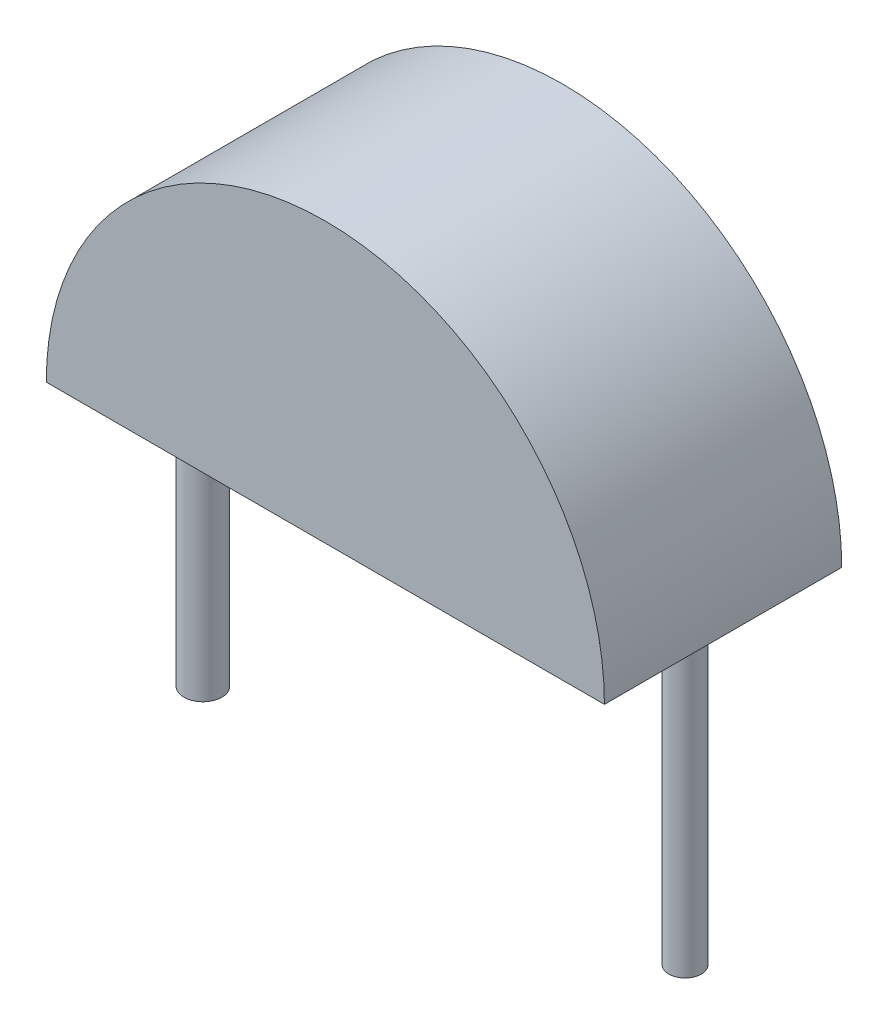
ISO-10303-21;
HEADER;
FILE_DESCRIPTION(('STEP AP214'),'2;1');
FILE_NAME('part.step','',(''),(''),'','','');
FILE_SCHEMA(('AUTOMOTIVE_DESIGN { 1 0 10303 214 1 1 1 1 }'));
ENDSEC;
DATA;
#1=APPLICATION_CONTEXT('core data for automotive mechanical design processes');
#2=APPLICATION_PROTOCOL_DEFINITION('international standard','automotive_design',2000,#1);
#3=PRODUCT_CONTEXT('',#1,'mechanical');
#4=PRODUCT('Part','Part','',(#3));
#5=PRODUCT_RELATED_PRODUCT_CATEGORY('part','',(#4));
#6=PRODUCT_DEFINITION_FORMATION('','',#4);
#7=PRODUCT_DEFINITION_CONTEXT('part definition',#1,'design');
#8=PRODUCT_DEFINITION('design','',#6,#7);
#9=PRODUCT_DEFINITION_SHAPE('','',#8);
#10=(LENGTH_UNIT() NAMED_UNIT(*) SI_UNIT(.MILLI.,.METRE.));
#11=(NAMED_UNIT(*) PLANE_ANGLE_UNIT() SI_UNIT($,.RADIAN.));
#12=(NAMED_UNIT(*) SI_UNIT($,.STERADIAN.) SOLID_ANGLE_UNIT());
#13=UNCERTAINTY_MEASURE_WITH_UNIT(LENGTH_MEASURE(1.E-05),#10,'distance_accuracy_value','');
#14=(GEOMETRIC_REPRESENTATION_CONTEXT(3) GLOBAL_UNCERTAINTY_ASSIGNED_CONTEXT((#13)) GLOBAL_UNIT_ASSIGNED_CONTEXT((#10,
#11,#12)) REPRESENTATION_CONTEXT('',''));
#15=CARTESIAN_POINT('',(0.,0.,0.));
#16=DIRECTION('',(0.,0.,1.));
#17=DIRECTION('',(1.,0.,0.));
#18=AXIS2_PLACEMENT_3D('',#15,#16,#17);
#19=CARTESIAN_POINT('',(0.,0.,2.5));
#20=DIRECTION('',(0.,0.,-1.));
#21=DIRECTION('',(-1.,0.,0.));
#22=AXIS2_PLACEMENT_3D('',#19,#20,#21);
#23=CYLINDRICAL_SURFACE('',#22,2.94);
#24=CARTESIAN_POINT('',(0.,0.,0.));
#25=DIRECTION('',(0.,0.,1.));
#26=DIRECTION('',(1.,0.,0.));
#27=AXIS2_PLACEMENT_3D('',#24,#25,#26);
#28=CIRCLE('',#27,2.94);
#29=CARTESIAN_POINT('',(2.94,0.,0.));
#30=VERTEX_POINT('',#29);
#31=CARTESIAN_POINT('',(-2.94,0.,0.));
#32=VERTEX_POINT('',#31);
#33=EDGE_CURVE('E81',#30,#32,#28,.T.);
#34=ORIENTED_EDGE('',*,*,#33,.T.);
#35=DIRECTION('',(0.,0.,-1.));
#36=VECTOR('',#35,1.);
#37=CARTESIAN_POINT('',(-2.94,0.,2.5));
#38=LINE('',#37,#36);
#39=CARTESIAN_POINT('',(-2.94,0.,2.5));
#40=VERTEX_POINT('',#39);
#41=EDGE_CURVE('E77',#40,#32,#38,.T.);
#42=ORIENTED_EDGE('',*,*,#41,.F.);
#43=CARTESIAN_POINT('',(0.,0.,2.5));
#44=DIRECTION('',(0.,0.,1.));
#45=DIRECTION('',(1.,0.,0.));
#46=AXIS2_PLACEMENT_3D('',#43,#44,#45);
#47=CIRCLE('',#46,2.94);
#48=CARTESIAN_POINT('',(2.94,0.,2.5));
#49=VERTEX_POINT('',#48);
#50=EDGE_CURVE('E80',#49,#40,#47,.T.);
#51=ORIENTED_EDGE('',*,*,#50,.F.);
#52=DIRECTION('',(0.,0.,-1.));
#53=VECTOR('',#52,1.);
#54=CARTESIAN_POINT('',(2.94,0.,2.5));
#55=LINE('',#54,#53);
#56=EDGE_CURVE('E74',#49,#30,#55,.T.);
#57=ORIENTED_EDGE('',*,*,#56,.T.);
#58=EDGE_LOOP('',(#34,#42,#51,#57));
#59=FACE_BOUND('',#58,.T.);
#60=ADVANCED_FACE('F45',(#59),#23,.T.);
#61=CARTESIAN_POINT('',(-2.94,0.,2.5));
#62=DIRECTION('',(0.,1.,0.));
#63=DIRECTION('',(0.,0.,1.));
#64=AXIS2_PLACEMENT_3D('',#61,#62,#63);
#65=PLANE('',#64);
#66=CARTESIAN_POINT('',(2.54,0.,1.25));
#67=DIRECTION('',(0.,1.,0.));
#68=DIRECTION('',(0.,0.,1.));
#69=AXIS2_PLACEMENT_3D('',#66,#67,#68);
#70=CIRCLE('',#69,0.171619635715955);
#71=CARTESIAN_POINT('',(2.54,0.,1.42161963571595));
#72=VERTEX_POINT('',#71);
#73=EDGE_CURVE('E11',#72,#72,#70,.F.);
#74=ORIENTED_EDGE('',*,*,#73,.F.);
#75=EDGE_LOOP('',(#74));
#76=FACE_BOUND('',#75,.T.);
#77=CARTESIAN_POINT('',(-2.54,0.,1.25));
#78=DIRECTION('',(0.,1.,0.));
#79=DIRECTION('',(0.,0.,1.));
#80=AXIS2_PLACEMENT_3D('',#77,#78,#79);
#81=CIRCLE('',#80,0.2);
#82=CARTESIAN_POINT('',(-2.54,0.,1.45));
#83=VERTEX_POINT('',#82);
#84=EDGE_CURVE('E54',#83,#83,#81,.F.);
#85=ORIENTED_EDGE('',*,*,#84,.F.);
#86=EDGE_LOOP('',(#85));
#87=FACE_BOUND('',#86,.T.);
#88=DIRECTION('',(1.,0.,0.));
#89=VECTOR('',#88,1.);
#90=CARTESIAN_POINT('',(-2.94,0.,0.));
#91=LINE('',#90,#89);
#92=EDGE_CURVE('E69',#32,#30,#91,.T.);
#93=ORIENTED_EDGE('',*,*,#92,.T.);
#94=ORIENTED_EDGE('',*,*,#56,.F.);
#95=DIRECTION('',(1.,0.,0.));
#96=VECTOR('',#95,1.);
#97=CARTESIAN_POINT('',(-2.94,0.,2.5));
#98=LINE('',#97,#96);
#99=EDGE_CURVE('E61',#40,#49,#98,.T.);
#100=ORIENTED_EDGE('',*,*,#99,.F.);
#101=ORIENTED_EDGE('',*,*,#41,.T.);
#102=EDGE_LOOP('',(#93,#94,#100,#101));
#103=FACE_BOUND('',#102,.T.);
#104=ADVANCED_FACE('F73',(#76,#87,#103),#65,.F.);
#105=CARTESIAN_POINT('',(0.,0.,2.5));
#106=DIRECTION('',(0.,0.,1.));
#107=DIRECTION('',(1.,0.,0.));
#108=AXIS2_PLACEMENT_3D('',#105,#106,#107);
#109=PLANE('',#108);
#110=ORIENTED_EDGE('',*,*,#50,.T.);
#111=ORIENTED_EDGE('',*,*,#99,.T.);
#112=EDGE_LOOP('',(#110,#111));
#113=FACE_BOUND('',#112,.T.);
#114=ADVANCED_FACE('F105',(#113),#109,.T.);
#115=CARTESIAN_POINT('',(0.,0.,0.));
#116=DIRECTION('',(0.,0.,1.));
#117=DIRECTION('',(1.,0.,0.));
#118=AXIS2_PLACEMENT_3D('',#115,#116,#117);
#119=PLANE('',#118);
#120=ORIENTED_EDGE('',*,*,#33,.F.);
#121=ORIENTED_EDGE('',*,*,#92,.F.);
#122=EDGE_LOOP('',(#120,#121));
#123=FACE_BOUND('',#122,.T.);
#124=ADVANCED_FACE('F86',(#123),#119,.F.);
#125=CARTESIAN_POINT('',(-2.54,-3.2,1.25));
#126=DIRECTION('',(0.,1.,0.));
#127=DIRECTION('',(0.,0.,1.));
#128=AXIS2_PLACEMENT_3D('',#125,#126,#127);
#129=CYLINDRICAL_SURFACE('',#128,0.2);
#130=CARTESIAN_POINT('',(-2.54,-3.2,1.25));
#131=DIRECTION('',(0.,-1.,0.));
#132=DIRECTION('',(0.,0.,-1.));
#133=AXIS2_PLACEMENT_3D('',#130,#131,#132);
#134=CIRCLE('',#133,0.2);
#135=CARTESIAN_POINT('',(-2.54,-3.2,1.05));
#136=VERTEX_POINT('',#135);
#137=EDGE_CURVE('E88',#136,#136,#134,.T.);
#138=ORIENTED_EDGE('',*,*,#137,.F.);
#139=EDGE_LOOP('',(#138));
#140=FACE_BOUND('',#139,.T.);
#141=ORIENTED_EDGE('',*,*,#84,.T.);
#142=EDGE_LOOP('',(#141));
#143=FACE_BOUND('',#142,.T.);
#144=ADVANCED_FACE('F102',(#140,#143),#129,.T.);
#145=CARTESIAN_POINT('',(-2.54,-3.2,1.25));
#146=DIRECTION('',(0.,-1.,0.));
#147=DIRECTION('',(0.,0.,-1.));
#148=AXIS2_PLACEMENT_3D('',#145,#146,#147);
#149=PLANE('',#148);
#150=ORIENTED_EDGE('',*,*,#137,.T.);
#151=EDGE_LOOP('',(#150));
#152=FACE_BOUND('',#151,.T.);
#153=ADVANCED_FACE('F118',(#152),#149,.T.);
#154=CARTESIAN_POINT('',(2.54,-3.2,1.25));
#155=DIRECTION('',(0.,1.,0.));
#156=DIRECTION('',(0.,0.,1.));
#157=AXIS2_PLACEMENT_3D('',#154,#155,#156);
#158=CYLINDRICAL_SURFACE('',#157,0.171619635715955);
#159=CARTESIAN_POINT('',(2.54,-3.2,1.25));
#160=DIRECTION('',(0.,-1.,0.));
#161=DIRECTION('',(0.,0.,-1.));
#162=AXIS2_PLACEMENT_3D('',#159,#160,#161);
#163=CIRCLE('',#162,0.171619635715955);
#164=CARTESIAN_POINT('',(2.54,-3.2,1.07838036428405));
#165=VERTEX_POINT('',#164);
#166=EDGE_CURVE('E92',#165,#165,#163,.T.);
#167=ORIENTED_EDGE('',*,*,#166,.F.);
#168=EDGE_LOOP('',(#167));
#169=FACE_BOUND('',#168,.T.);
#170=ORIENTED_EDGE('',*,*,#73,.T.);
#171=EDGE_LOOP('',(#170));
#172=FACE_BOUND('',#171,.T.);
#173=ADVANCED_FACE('F122',(#169,#172),#158,.T.);
#174=CARTESIAN_POINT('',(2.54,-3.2,1.25));
#175=DIRECTION('',(0.,-1.,0.));
#176=DIRECTION('',(0.,0.,-1.));
#177=AXIS2_PLACEMENT_3D('',#174,#175,#176);
#178=PLANE('',#177);
#179=ORIENTED_EDGE('',*,*,#166,.T.);
#180=EDGE_LOOP('',(#179));
#181=FACE_BOUND('',#180,.T.);
#182=ADVANCED_FACE('F124',(#181),#178,.T.);
#183=CLOSED_SHELL('',(#60,#104,#114,#124,#144,#153,#173,#182));
#184=MANIFOLD_SOLID_BREP('B2',#183);
#185=ADVANCED_BREP_SHAPE_REPRESENTATION('',(#18,#184),#14);
#186=SHAPE_DEFINITION_REPRESENTATION(#9,#185);
ENDSEC;
END-ISO-10303-21;
